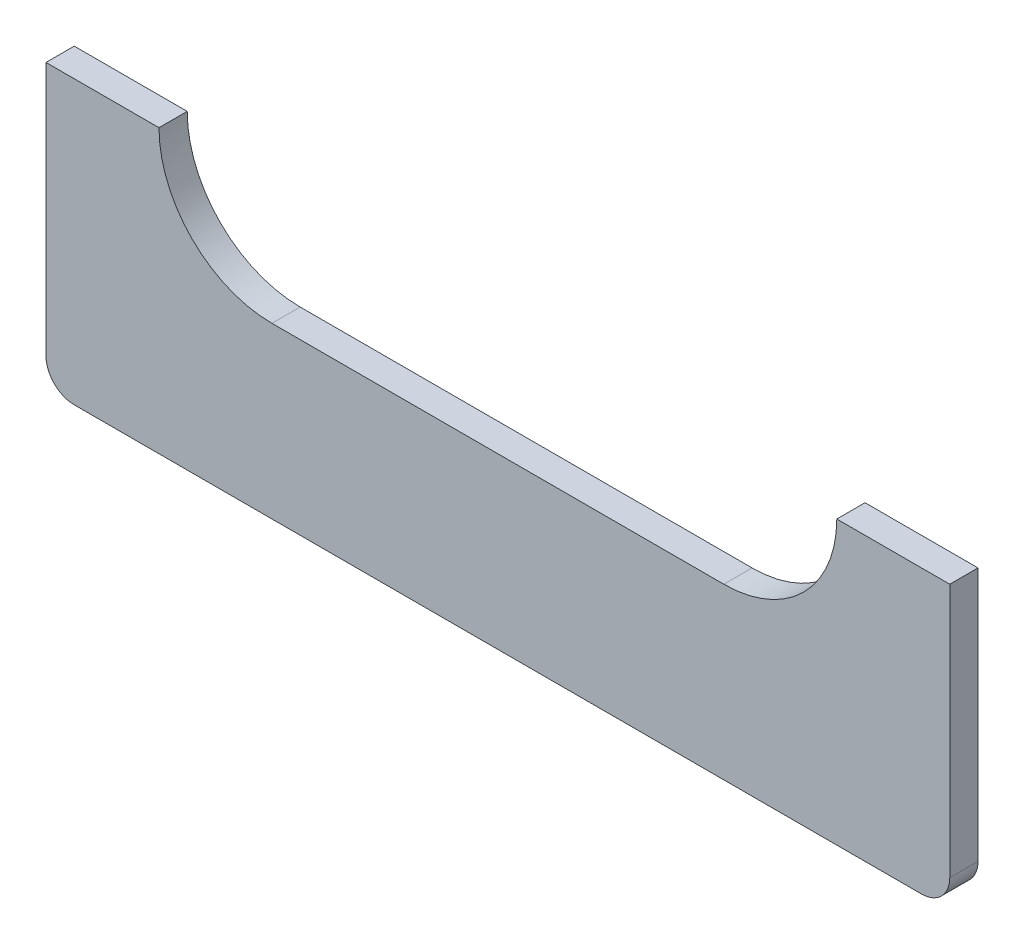
ISO-10303-21;
HEADER;
FILE_DESCRIPTION(('STEP AP214'),'2;1');
FILE_NAME('part.step','',(''),(''),'','','');
FILE_SCHEMA(('AUTOMOTIVE_DESIGN { 1 0 10303 214 1 1 1 1 }'));
ENDSEC;
DATA;
#1=APPLICATION_CONTEXT('core data for automotive mechanical design processes');
#2=APPLICATION_PROTOCOL_DEFINITION('international standard','automotive_design',2000,#1);
#3=PRODUCT_CONTEXT('',#1,'mechanical');
#4=PRODUCT('Part','Part','',(#3));
#5=PRODUCT_RELATED_PRODUCT_CATEGORY('part','',(#4));
#6=PRODUCT_DEFINITION_FORMATION('','',#4);
#7=PRODUCT_DEFINITION_CONTEXT('part definition',#1,'design');
#8=PRODUCT_DEFINITION('design','',#6,#7);
#9=PRODUCT_DEFINITION_SHAPE('','',#8);
#10=(LENGTH_UNIT() NAMED_UNIT(*) SI_UNIT(.MILLI.,.METRE.));
#11=(NAMED_UNIT(*) PLANE_ANGLE_UNIT() SI_UNIT($,.RADIAN.));
#12=(NAMED_UNIT(*) SI_UNIT($,.STERADIAN.) SOLID_ANGLE_UNIT());
#13=UNCERTAINTY_MEASURE_WITH_UNIT(LENGTH_MEASURE(1.E-05),#10,'distance_accuracy_value','');
#14=(GEOMETRIC_REPRESENTATION_CONTEXT(3) GLOBAL_UNCERTAINTY_ASSIGNED_CONTEXT((#13)) GLOBAL_UNIT_ASSIGNED_CONTEXT((#10,
#11,#12)) REPRESENTATION_CONTEXT('',''));
#15=CARTESIAN_POINT('',(0.,0.,0.));
#16=DIRECTION('',(0.,0.,1.));
#17=DIRECTION('',(1.,0.,0.));
#18=AXIS2_PLACEMENT_3D('',#15,#16,#17);
#19=CARTESIAN_POINT('',(-101.6,0.,6.35));
#20=DIRECTION('',(1.,0.,0.));
#21=DIRECTION('',(0.,0.,-1.));
#22=AXIS2_PLACEMENT_3D('',#19,#20,#21);
#23=PLANE('',#22);
#24=DIRECTION('',(0.,-1.,0.));
#25=VECTOR('',#24,1.);
#26=CARTESIAN_POINT('',(-101.6,0.,0.));
#27=LINE('',#26,#25);
#28=CARTESIAN_POINT('',(-101.6,0.,0.));
#29=VERTEX_POINT('',#28);
#30=CARTESIAN_POINT('',(-101.6,-57.15,0.));
#31=VERTEX_POINT('',#30);
#32=EDGE_CURVE('E190',#29,#31,#27,.T.);
#33=ORIENTED_EDGE('',*,*,#32,.T.);
#34=DIRECTION('',(0.,0.,-1.));
#35=VECTOR('',#34,1.);
#36=CARTESIAN_POINT('',(-101.6,-57.15,6.35));
#37=LINE('',#36,#35);
#38=CARTESIAN_POINT('',(-101.6,-57.15,6.35));
#39=VERTEX_POINT('',#38);
#40=EDGE_CURVE('E11',#31,#39,#37,.F.);
#41=ORIENTED_EDGE('',*,*,#40,.T.);
#42=DIRECTION('',(0.,-1.,0.));
#43=VECTOR('',#42,1.);
#44=CARTESIAN_POINT('',(-101.6,0.,6.35));
#45=LINE('',#44,#43);
#46=CARTESIAN_POINT('',(-101.6,0.,6.35));
#47=VERTEX_POINT('',#46);
#48=EDGE_CURVE('E144',#47,#39,#45,.T.);
#49=ORIENTED_EDGE('',*,*,#48,.F.);
#50=DIRECTION('',(0.,0.,-1.));
#51=VECTOR('',#50,1.);
#52=CARTESIAN_POINT('',(-101.6,0.,6.35));
#53=LINE('',#52,#51);
#54=EDGE_CURVE('E159',#47,#29,#53,.T.);
#55=ORIENTED_EDGE('',*,*,#54,.T.);
#56=EDGE_LOOP('',(#33,#41,#49,#55));
#57=FACE_BOUND('',#56,.T.);
#58=ADVANCED_FACE('F31',(#57),#23,.F.);
#59=CARTESIAN_POINT('',(-101.6,-63.5,6.35));
#60=DIRECTION('',(0.,1.,0.));
#61=DIRECTION('',(0.,0.,1.));
#62=AXIS2_PLACEMENT_3D('',#59,#60,#61);
#63=PLANE('',#62);
#64=DIRECTION('',(1.,0.,0.));
#65=VECTOR('',#64,1.);
#66=CARTESIAN_POINT('',(-101.6,-63.5,0.));
#67=LINE('',#66,#65);
#68=CARTESIAN_POINT('',(-95.25,-63.5,0.));
#69=VERTEX_POINT('',#68);
#70=CARTESIAN_POINT('',(95.25,-63.5,0.));
#71=VERTEX_POINT('',#70);
#72=EDGE_CURVE('E121',#69,#71,#67,.T.);
#73=ORIENTED_EDGE('',*,*,#72,.T.);
#74=DIRECTION('',(0.,0.,-1.));
#75=VECTOR('',#74,1.);
#76=CARTESIAN_POINT('',(95.25,-63.5,6.35));
#77=LINE('',#76,#75);
#78=CARTESIAN_POINT('',(95.25,-63.5,6.35));
#79=VERTEX_POINT('',#78);
#80=EDGE_CURVE('E51',#71,#79,#77,.F.);
#81=ORIENTED_EDGE('',*,*,#80,.T.);
#82=DIRECTION('',(1.,0.,0.));
#83=VECTOR('',#82,1.);
#84=CARTESIAN_POINT('',(-101.6,-63.5,6.35));
#85=LINE('',#84,#83);
#86=CARTESIAN_POINT('',(-95.25,-63.5,6.35));
#87=VERTEX_POINT('',#86);
#88=EDGE_CURVE('E146',#87,#79,#85,.T.);
#89=ORIENTED_EDGE('',*,*,#88,.F.);
#90=DIRECTION('',(0.,0.,-1.));
#91=VECTOR('',#90,1.);
#92=CARTESIAN_POINT('',(-95.25,-63.5,6.35));
#93=LINE('',#92,#91);
#94=EDGE_CURVE('E177',#87,#69,#93,.T.);
#95=ORIENTED_EDGE('',*,*,#94,.T.);
#96=EDGE_LOOP('',(#73,#81,#89,#95));
#97=FACE_BOUND('',#96,.T.);
#98=ADVANCED_FACE('F188',(#97),#63,.F.);
#99=CARTESIAN_POINT('',(101.6,0.,6.35));
#100=DIRECTION('',(-1.,0.,0.));
#101=DIRECTION('',(0.,-1.,0.));
#102=AXIS2_PLACEMENT_3D('',#99,#100,#101);
#103=PLANE('',#102);
#104=DIRECTION('',(0.,1.,0.));
#105=VECTOR('',#104,1.);
#106=CARTESIAN_POINT('',(101.6,0.,6.35));
#107=LINE('',#106,#105);
#108=CARTESIAN_POINT('',(101.6,-57.15,6.35));
#109=VERTEX_POINT('',#108);
#110=CARTESIAN_POINT('',(101.6,0.,6.35));
#111=VERTEX_POINT('',#110);
#112=EDGE_CURVE('E148',#109,#111,#107,.T.);
#113=ORIENTED_EDGE('',*,*,#112,.F.);
#114=DIRECTION('',(0.,0.,-1.));
#115=VECTOR('',#114,1.);
#116=CARTESIAN_POINT('',(101.6,-57.15,6.35));
#117=LINE('',#116,#115);
#118=CARTESIAN_POINT('',(101.6,-57.15,0.));
#119=VERTEX_POINT('',#118);
#120=EDGE_CURVE('E117',#109,#119,#117,.T.);
#121=ORIENTED_EDGE('',*,*,#120,.T.);
#122=DIRECTION('',(0.,1.,0.));
#123=VECTOR('',#122,1.);
#124=CARTESIAN_POINT('',(101.6,0.,0.));
#125=LINE('',#124,#123);
#126=CARTESIAN_POINT('',(101.6,0.,0.));
#127=VERTEX_POINT('',#126);
#128=EDGE_CURVE('E110',#119,#127,#125,.T.);
#129=ORIENTED_EDGE('',*,*,#128,.T.);
#130=DIRECTION('',(0.,0.,-1.));
#131=VECTOR('',#130,1.);
#132=CARTESIAN_POINT('',(101.6,0.,6.35));
#133=LINE('',#132,#131);
#134=EDGE_CURVE('E114',#111,#127,#133,.T.);
#135=ORIENTED_EDGE('',*,*,#134,.F.);
#136=EDGE_LOOP('',(#113,#121,#129,#135));
#137=FACE_BOUND('',#136,.T.);
#138=ADVANCED_FACE('F113',(#137),#103,.F.);
#139=CARTESIAN_POINT('',(76.2,0.,6.35));
#140=DIRECTION('',(0.,-1.,0.));
#141=DIRECTION('',(1.,0.,0.));
#142=AXIS2_PLACEMENT_3D('',#139,#140,#141);
#143=PLANE('',#142);
#144=DIRECTION('',(-1.,0.,0.));
#145=VECTOR('',#144,1.);
#146=CARTESIAN_POINT('',(76.2,0.,0.));
#147=LINE('',#146,#145);
#148=CARTESIAN_POINT('',(76.2,0.,0.));
#149=VERTEX_POINT('',#148);
#150=EDGE_CURVE('E120',#127,#149,#147,.T.);
#151=ORIENTED_EDGE('',*,*,#150,.T.);
#152=DIRECTION('',(0.,0.,-1.));
#153=VECTOR('',#152,1.);
#154=CARTESIAN_POINT('',(76.2,0.,6.35));
#155=LINE('',#154,#153);
#156=CARTESIAN_POINT('',(76.2,0.,6.35));
#157=VERTEX_POINT('',#156);
#158=EDGE_CURVE('E128',#157,#149,#155,.T.);
#159=ORIENTED_EDGE('',*,*,#158,.F.);
#160=DIRECTION('',(-1.,0.,0.));
#161=VECTOR('',#160,1.);
#162=CARTESIAN_POINT('',(76.2,0.,6.35));
#163=LINE('',#162,#161);
#164=EDGE_CURVE('E127',#111,#157,#163,.T.);
#165=ORIENTED_EDGE('',*,*,#164,.F.);
#166=ORIENTED_EDGE('',*,*,#134,.T.);
#167=EDGE_LOOP('',(#151,#159,#165,#166));
#168=FACE_BOUND('',#167,.T.);
#169=ADVANCED_FACE('F124',(#168),#143,.F.);
#170=CARTESIAN_POINT('',(50.8,0.,6.35));
#171=DIRECTION('',(0.,0.,-1.));
#172=DIRECTION('',(-1.,0.,0.));
#173=AXIS2_PLACEMENT_3D('',#170,#171,#172);
#174=CYLINDRICAL_SURFACE('',#173,25.4);
#175=CARTESIAN_POINT('',(50.8,0.,0.));
#176=DIRECTION('',(0.,0.,-1.));
#177=DIRECTION('',(-1.,0.,0.));
#178=AXIS2_PLACEMENT_3D('',#175,#176,#177);
#179=CIRCLE('',#178,25.4);
#180=CARTESIAN_POINT('',(50.8,-25.4,0.));
#181=VERTEX_POINT('',#180);
#182=EDGE_CURVE('E133',#149,#181,#179,.T.);
#183=ORIENTED_EDGE('',*,*,#182,.T.);
#184=DIRECTION('',(0.,0.,-1.));
#185=VECTOR('',#184,1.);
#186=CARTESIAN_POINT('',(50.8,-25.4,6.35));
#187=LINE('',#186,#185);
#188=CARTESIAN_POINT('',(50.8,-25.4,6.35));
#189=VERTEX_POINT('',#188);
#190=EDGE_CURVE('E168',#189,#181,#187,.T.);
#191=ORIENTED_EDGE('',*,*,#190,.F.);
#192=CARTESIAN_POINT('',(50.8,0.,6.35));
#193=DIRECTION('',(0.,0.,-1.));
#194=DIRECTION('',(-1.,0.,0.));
#195=AXIS2_PLACEMENT_3D('',#192,#193,#194);
#196=CIRCLE('',#195,25.4);
#197=EDGE_CURVE('E151',#157,#189,#196,.T.);
#198=ORIENTED_EDGE('',*,*,#197,.F.);
#199=ORIENTED_EDGE('',*,*,#158,.T.);
#200=EDGE_LOOP('',(#183,#191,#198,#199));
#201=FACE_BOUND('',#200,.T.);
#202=ADVANCED_FACE('F213',(#201),#174,.F.);
#203=CARTESIAN_POINT('',(-50.8,-25.4,6.35));
#204=DIRECTION('',(0.,-1.,0.));
#205=DIRECTION('',(1.,0.,0.));
#206=AXIS2_PLACEMENT_3D('',#203,#204,#205);
#207=PLANE('',#206);
#208=DIRECTION('',(-1.,0.,0.));
#209=VECTOR('',#208,1.);
#210=CARTESIAN_POINT('',(-50.8,-25.4,0.));
#211=LINE('',#210,#209);
#212=CARTESIAN_POINT('',(-50.8,-25.4,0.));
#213=VERTEX_POINT('',#212);
#214=EDGE_CURVE('E135',#181,#213,#211,.T.);
#215=ORIENTED_EDGE('',*,*,#214,.T.);
#216=DIRECTION('',(0.,0.,-1.));
#217=VECTOR('',#216,1.);
#218=CARTESIAN_POINT('',(-50.8,-25.4,6.35));
#219=LINE('',#218,#217);
#220=CARTESIAN_POINT('',(-50.8,-25.4,6.35));
#221=VERTEX_POINT('',#220);
#222=EDGE_CURVE('E165',#221,#213,#219,.T.);
#223=ORIENTED_EDGE('',*,*,#222,.F.);
#224=DIRECTION('',(-1.,0.,0.));
#225=VECTOR('',#224,1.);
#226=CARTESIAN_POINT('',(-50.8,-25.4,6.35));
#227=LINE('',#226,#225);
#228=EDGE_CURVE('E153',#189,#221,#227,.T.);
#229=ORIENTED_EDGE('',*,*,#228,.F.);
#230=ORIENTED_EDGE('',*,*,#190,.T.);
#231=EDGE_LOOP('',(#215,#223,#229,#230));
#232=FACE_BOUND('',#231,.T.);
#233=ADVANCED_FACE('F209',(#232),#207,.F.);
#234=CARTESIAN_POINT('',(-50.8,0.,6.35));
#235=DIRECTION('',(0.,0.,-1.));
#236=DIRECTION('',(-1.,0.,0.));
#237=AXIS2_PLACEMENT_3D('',#234,#235,#236);
#238=CYLINDRICAL_SURFACE('',#237,25.4);
#239=CARTESIAN_POINT('',(-50.8,0.,0.));
#240=DIRECTION('',(0.,0.,-1.));
#241=DIRECTION('',(1.,0.,0.));
#242=AXIS2_PLACEMENT_3D('',#239,#240,#241);
#243=CIRCLE('',#242,25.4);
#244=CARTESIAN_POINT('',(-76.2,0.,0.));
#245=VERTEX_POINT('',#244);
#246=EDGE_CURVE('E140',#213,#245,#243,.T.);
#247=ORIENTED_EDGE('',*,*,#246,.T.);
#248=DIRECTION('',(0.,0.,-1.));
#249=VECTOR('',#248,1.);
#250=CARTESIAN_POINT('',(-76.2,0.,6.35));
#251=LINE('',#250,#249);
#252=CARTESIAN_POINT('',(-76.2,0.,6.35));
#253=VERTEX_POINT('',#252);
#254=EDGE_CURVE('E162',#253,#245,#251,.T.);
#255=ORIENTED_EDGE('',*,*,#254,.F.);
#256=CARTESIAN_POINT('',(-50.8,0.,6.35));
#257=DIRECTION('',(0.,0.,-1.));
#258=DIRECTION('',(1.,0.,0.));
#259=AXIS2_PLACEMENT_3D('',#256,#257,#258);
#260=CIRCLE('',#259,25.4);
#261=EDGE_CURVE('E155',#221,#253,#260,.T.);
#262=ORIENTED_EDGE('',*,*,#261,.F.);
#263=ORIENTED_EDGE('',*,*,#222,.T.);
#264=EDGE_LOOP('',(#247,#255,#262,#263));
#265=FACE_BOUND('',#264,.T.);
#266=ADVANCED_FACE('F205',(#265),#238,.F.);
#267=CARTESIAN_POINT('',(-101.6,0.,6.35));
#268=DIRECTION('',(0.,-1.,0.));
#269=DIRECTION('',(0.,0.,-1.));
#270=AXIS2_PLACEMENT_3D('',#267,#268,#269);
#271=PLANE('',#270);
#272=DIRECTION('',(-1.,0.,0.));
#273=VECTOR('',#272,1.);
#274=CARTESIAN_POINT('',(-101.6,0.,0.));
#275=LINE('',#274,#273);
#276=EDGE_CURVE('E142',#245,#29,#275,.T.);
#277=ORIENTED_EDGE('',*,*,#276,.T.);
#278=ORIENTED_EDGE('',*,*,#54,.F.);
#279=DIRECTION('',(-1.,0.,0.));
#280=VECTOR('',#279,1.);
#281=CARTESIAN_POINT('',(-101.6,0.,6.35));
#282=LINE('',#281,#280);
#283=EDGE_CURVE('E157',#253,#47,#282,.T.);
#284=ORIENTED_EDGE('',*,*,#283,.F.);
#285=ORIENTED_EDGE('',*,*,#254,.T.);
#286=EDGE_LOOP('',(#277,#278,#284,#285));
#287=FACE_BOUND('',#286,.T.);
#288=ADVANCED_FACE('F202',(#287),#271,.F.);
#289=CARTESIAN_POINT('',(50.8,0.,6.35));
#290=DIRECTION('',(0.,0.,-1.));
#291=DIRECTION('',(-1.,0.,0.));
#292=AXIS2_PLACEMENT_3D('',#289,#290,#291);
#293=PLANE('',#292);
#294=ORIENTED_EDGE('',*,*,#88,.T.);
#295=CARTESIAN_POINT('',(95.25,-57.15,6.35));
#296=DIRECTION('',(0.,0.,-1.));
#297=DIRECTION('',(-1.,0.,0.));
#298=AXIS2_PLACEMENT_3D('',#295,#296,#297);
#299=CIRCLE('',#298,6.35);
#300=EDGE_CURVE('E38',#79,#109,#299,.F.);
#301=ORIENTED_EDGE('',*,*,#300,.T.);
#302=ORIENTED_EDGE('',*,*,#112,.T.);
#303=ORIENTED_EDGE('',*,*,#164,.T.);
#304=ORIENTED_EDGE('',*,*,#197,.T.);
#305=ORIENTED_EDGE('',*,*,#228,.T.);
#306=ORIENTED_EDGE('',*,*,#261,.T.);
#307=ORIENTED_EDGE('',*,*,#283,.T.);
#308=ORIENTED_EDGE('',*,*,#48,.T.);
#309=CARTESIAN_POINT('',(-95.25,-57.15,6.35));
#310=DIRECTION('',(0.,0.,-1.));
#311=DIRECTION('',(-1.,0.,0.));
#312=AXIS2_PLACEMENT_3D('',#309,#310,#311);
#313=CIRCLE('',#312,6.35);
#314=EDGE_CURVE('E181',#39,#87,#313,.F.);
#315=ORIENTED_EDGE('',*,*,#314,.T.);
#316=EDGE_LOOP('',(#294,#301,#302,#303,#304,#305,#306,#307,#308,#315));
#317=FACE_BOUND('',#316,.T.);
#318=ADVANCED_FACE('F184',(#317),#293,.F.);
#319=CARTESIAN_POINT('',(50.8,0.,0.));
#320=DIRECTION('',(0.,0.,-1.));
#321=DIRECTION('',(-1.,0.,0.));
#322=AXIS2_PLACEMENT_3D('',#319,#320,#321);
#323=PLANE('',#322);
#324=ORIENTED_EDGE('',*,*,#128,.F.);
#325=CARTESIAN_POINT('',(95.25,-57.15,0.));
#326=DIRECTION('',(0.,0.,-1.));
#327=DIRECTION('',(-1.,0.,0.));
#328=AXIS2_PLACEMENT_3D('',#325,#326,#327);
#329=CIRCLE('',#328,6.35);
#330=EDGE_CURVE('E175',#119,#71,#329,.T.);
#331=ORIENTED_EDGE('',*,*,#330,.T.);
#332=ORIENTED_EDGE('',*,*,#72,.F.);
#333=CARTESIAN_POINT('',(-95.25,-57.15,0.));
#334=DIRECTION('',(0.,0.,-1.));
#335=DIRECTION('',(-1.,0.,0.));
#336=AXIS2_PLACEMENT_3D('',#333,#334,#335);
#337=CIRCLE('',#336,6.35);
#338=EDGE_CURVE('E173',#69,#31,#337,.T.);
#339=ORIENTED_EDGE('',*,*,#338,.T.);
#340=ORIENTED_EDGE('',*,*,#32,.F.);
#341=ORIENTED_EDGE('',*,*,#276,.F.);
#342=ORIENTED_EDGE('',*,*,#246,.F.);
#343=ORIENTED_EDGE('',*,*,#214,.F.);
#344=ORIENTED_EDGE('',*,*,#182,.F.);
#345=ORIENTED_EDGE('',*,*,#150,.F.);
#346=EDGE_LOOP('',(#324,#331,#332,#339,#340,#341,#342,#343,#344,#345));
#347=FACE_BOUND('',#346,.T.);
#348=ADVANCED_FACE('F131',(#347),#323,.T.);
#349=CARTESIAN_POINT('',(95.25,-57.15,6.35));
#350=DIRECTION('',(0.,0.,-1.));
#351=DIRECTION('',(-1.,0.,0.));
#352=AXIS2_PLACEMENT_3D('',#349,#350,#351);
#353=CYLINDRICAL_SURFACE('',#352,6.35);
#354=ORIENTED_EDGE('',*,*,#300,.F.);
#355=ORIENTED_EDGE('',*,*,#80,.F.);
#356=ORIENTED_EDGE('',*,*,#330,.F.);
#357=ORIENTED_EDGE('',*,*,#120,.F.);
#358=EDGE_LOOP('',(#354,#355,#356,#357));
#359=FACE_BOUND('',#358,.T.);
#360=ADVANCED_FACE('F186',(#359),#353,.T.);
#361=CARTESIAN_POINT('',(-95.25,-57.15,6.35));
#362=DIRECTION('',(0.,0.,-1.));
#363=DIRECTION('',(-1.,0.,0.));
#364=AXIS2_PLACEMENT_3D('',#361,#362,#363);
#365=CYLINDRICAL_SURFACE('',#364,6.35);
#366=ORIENTED_EDGE('',*,*,#314,.F.);
#367=ORIENTED_EDGE('',*,*,#40,.F.);
#368=ORIENTED_EDGE('',*,*,#338,.F.);
#369=ORIENTED_EDGE('',*,*,#94,.F.);
#370=EDGE_LOOP('',(#366,#367,#368,#369));
#371=FACE_BOUND('',#370,.T.);
#372=ADVANCED_FACE('F197',(#371),#365,.T.);
#373=CLOSED_SHELL('',(#58,#98,#138,#169,#202,#233,#266,#288,#318,#348,#360,#372));
#374=MANIFOLD_SOLID_BREP('B2',#373);
#375=ADVANCED_BREP_SHAPE_REPRESENTATION('',(#18,#374),#14);
#376=SHAPE_DEFINITION_REPRESENTATION(#9,#375);
ENDSEC;
END-ISO-10303-21;
